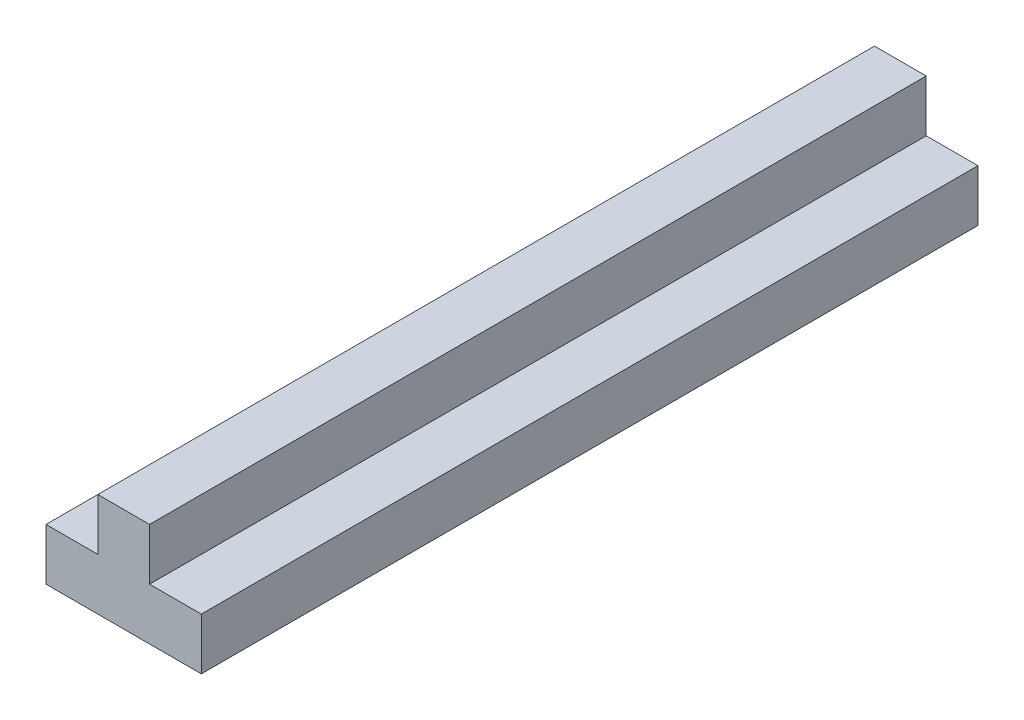
ISO-10303-21;
HEADER;
FILE_DESCRIPTION(('STEP AP214'),'2;1');
FILE_NAME('part.step','',(''),(''),'','','');
FILE_SCHEMA(('AUTOMOTIVE_DESIGN { 1 0 10303 214 1 1 1 1 }'));
ENDSEC;
DATA;
#1=APPLICATION_CONTEXT('core data for automotive mechanical design processes');
#2=APPLICATION_PROTOCOL_DEFINITION('international standard','automotive_design',2000,#1);
#3=PRODUCT_CONTEXT('',#1,'mechanical');
#4=PRODUCT('Part','Part','',(#3));
#5=PRODUCT_RELATED_PRODUCT_CATEGORY('part','',(#4));
#6=PRODUCT_DEFINITION_FORMATION('','',#4);
#7=PRODUCT_DEFINITION_CONTEXT('part definition',#1,'design');
#8=PRODUCT_DEFINITION('design','',#6,#7);
#9=PRODUCT_DEFINITION_SHAPE('','',#8);
#10=(LENGTH_UNIT() NAMED_UNIT(*) SI_UNIT(.MILLI.,.METRE.));
#11=(NAMED_UNIT(*) PLANE_ANGLE_UNIT() SI_UNIT($,.RADIAN.));
#12=(NAMED_UNIT(*) SI_UNIT($,.STERADIAN.) SOLID_ANGLE_UNIT());
#13=UNCERTAINTY_MEASURE_WITH_UNIT(LENGTH_MEASURE(1.E-05),#10,'distance_accuracy_value','');
#14=(GEOMETRIC_REPRESENTATION_CONTEXT(3) GLOBAL_UNCERTAINTY_ASSIGNED_CONTEXT((#13)) GLOBAL_UNIT_ASSIGNED_CONTEXT((#10,
#11,#12)) REPRESENTATION_CONTEXT('',''));
#15=CARTESIAN_POINT('',(0.,0.,0.));
#16=DIRECTION('',(0.,0.,1.));
#17=DIRECTION('',(1.,0.,0.));
#18=AXIS2_PLACEMENT_3D('',#15,#16,#17);
#19=CARTESIAN_POINT('',(-6.35,1.27,38.1));
#20=DIRECTION('',(0.,-1.,0.));
#21=DIRECTION('',(0.,0.,-1.));
#22=AXIS2_PLACEMENT_3D('',#19,#20,#21);
#23=PLANE('',#22);
#24=DIRECTION('',(0.,0.,1.));
#25=VECTOR('',#24,1.);
#26=CARTESIAN_POINT('',(-1.27,1.27,0.));
#27=LINE('',#26,#25);
#28=CARTESIAN_POINT('',(-1.27,1.27,0.));
#29=VERTEX_POINT('',#28);
#30=CARTESIAN_POINT('',(-1.27,1.27,38.1));
#31=VERTEX_POINT('',#30);
#32=EDGE_CURVE('E49',#29,#31,#27,.T.);
#33=ORIENTED_EDGE('',*,*,#32,.F.);
#34=DIRECTION('',(-1.,0.,0.));
#35=VECTOR('',#34,1.);
#36=CARTESIAN_POINT('',(-6.35,1.27,0.));
#37=LINE('',#36,#35);
#38=CARTESIAN_POINT('',(-3.81,1.27,0.));
#39=VERTEX_POINT('',#38);
#40=EDGE_CURVE('E145',#29,#39,#37,.T.);
#41=ORIENTED_EDGE('',*,*,#40,.T.);
#42=DIRECTION('',(0.,0.,-1.));
#43=VECTOR('',#42,1.);
#44=CARTESIAN_POINT('',(-3.81,1.27,0.));
#45=LINE('',#44,#43);
#46=CARTESIAN_POINT('',(-3.81,1.27,38.1));
#47=VERTEX_POINT('',#46);
#48=EDGE_CURVE('E132',#47,#39,#45,.T.);
#49=ORIENTED_EDGE('',*,*,#48,.F.);
#50=DIRECTION('',(-1.,0.,0.));
#51=VECTOR('',#50,1.);
#52=CARTESIAN_POINT('',(-6.35,1.27,38.1));
#53=LINE('',#52,#51);
#54=EDGE_CURVE('E54',#31,#47,#53,.T.);
#55=ORIENTED_EDGE('',*,*,#54,.F.);
#56=EDGE_LOOP('',(#33,#41,#49,#55));
#57=FACE_BOUND('',#56,.T.);
#58=ADVANCED_FACE('F33',(#57),#23,.F.);
#59=DIRECTION('',(0.,0.,-1.));
#60=VECTOR('',#59,1.);
#61=CARTESIAN_POINT('',(1.27,1.27,0.));
#62=LINE('',#61,#60);
#63=CARTESIAN_POINT('',(1.27,1.27,38.1));
#64=VERTEX_POINT('',#63);
#65=CARTESIAN_POINT('',(1.27,1.27,0.));
#66=VERTEX_POINT('',#65);
#67=EDGE_CURVE('E117',#64,#66,#62,.T.);
#68=ORIENTED_EDGE('',*,*,#67,.F.);
#69=CARTESIAN_POINT('',(3.81,1.27,38.1));
#70=VERTEX_POINT('',#69);
#71=EDGE_CURVE('E41',#70,#64,#53,.T.);
#72=ORIENTED_EDGE('',*,*,#71,.F.);
#73=DIRECTION('',(0.,0.,1.));
#74=VECTOR('',#73,1.);
#75=CARTESIAN_POINT('',(3.81,1.27,38.1));
#76=LINE('',#75,#74);
#77=CARTESIAN_POINT('',(3.81,1.27,0.));
#78=VERTEX_POINT('',#77);
#79=EDGE_CURVE('E143',#78,#70,#76,.T.);
#80=ORIENTED_EDGE('',*,*,#79,.F.);
#81=EDGE_CURVE('E146',#78,#66,#37,.T.);
#82=ORIENTED_EDGE('',*,*,#81,.T.);
#83=EDGE_LOOP('',(#68,#72,#80,#82));
#84=FACE_BOUND('',#83,.T.);
#85=ADVANCED_FACE('F167',(#84),#23,.F.);
#86=CARTESIAN_POINT('',(-6.35,-1.27,38.1));
#87=DIRECTION('',(0.,1.,0.));
#88=DIRECTION('',(0.,0.,1.));
#89=AXIS2_PLACEMENT_3D('',#86,#87,#88);
#90=PLANE('',#89);
#91=DIRECTION('',(0.,0.,1.));
#92=VECTOR('',#91,1.);
#93=CARTESIAN_POINT('',(-3.81,-1.27,0.));
#94=LINE('',#93,#92);
#95=CARTESIAN_POINT('',(-3.81,-1.27,0.));
#96=VERTEX_POINT('',#95);
#97=CARTESIAN_POINT('',(-3.81,-1.27,38.1));
#98=VERTEX_POINT('',#97);
#99=EDGE_CURVE('E122',#96,#98,#94,.T.);
#100=ORIENTED_EDGE('',*,*,#99,.F.);
#101=DIRECTION('',(1.,0.,0.));
#102=VECTOR('',#101,1.);
#103=CARTESIAN_POINT('',(-6.35,-1.27,0.));
#104=LINE('',#103,#102);
#105=CARTESIAN_POINT('',(3.81,-1.27,0.));
#106=VERTEX_POINT('',#105);
#107=EDGE_CURVE('E36',#96,#106,#104,.T.);
#108=ORIENTED_EDGE('',*,*,#107,.T.);
#109=DIRECTION('',(0.,0.,-1.));
#110=VECTOR('',#109,1.);
#111=CARTESIAN_POINT('',(3.81,-1.27,38.1));
#112=LINE('',#111,#110);
#113=CARTESIAN_POINT('',(3.81,-1.27,38.1));
#114=VERTEX_POINT('',#113);
#115=EDGE_CURVE('E138',#114,#106,#112,.T.);
#116=ORIENTED_EDGE('',*,*,#115,.F.);
#117=DIRECTION('',(1.,0.,0.));
#118=VECTOR('',#117,1.);
#119=CARTESIAN_POINT('',(-6.35,-1.27,38.1));
#120=LINE('',#119,#118);
#121=EDGE_CURVE('E11',#98,#114,#120,.T.);
#122=ORIENTED_EDGE('',*,*,#121,.F.);
#123=EDGE_LOOP('',(#100,#108,#116,#122));
#124=FACE_BOUND('',#123,.T.);
#125=ADVANCED_FACE('F161',(#124),#90,.F.);
#126=CARTESIAN_POINT('',(0.,0.,38.1));
#127=DIRECTION('',(0.,0.,-1.));
#128=DIRECTION('',(-1.,0.,0.));
#129=AXIS2_PLACEMENT_3D('',#126,#127,#128);
#130=PLANE('',#129);
#131=DIRECTION('',(0.,1.,0.));
#132=VECTOR('',#131,1.);
#133=CARTESIAN_POINT('',(-3.81,1.27,38.1));
#134=LINE('',#133,#132);
#135=EDGE_CURVE('E129',#98,#47,#134,.T.);
#136=ORIENTED_EDGE('',*,*,#135,.F.);
#137=ORIENTED_EDGE('',*,*,#121,.T.);
#138=DIRECTION('',(0.,-1.,0.));
#139=VECTOR('',#138,1.);
#140=CARTESIAN_POINT('',(3.81,1.27,38.1));
#141=LINE('',#140,#139);
#142=EDGE_CURVE('E135',#70,#114,#141,.T.);
#143=ORIENTED_EDGE('',*,*,#142,.F.);
#144=ORIENTED_EDGE('',*,*,#71,.T.);
#145=DIRECTION('',(0.,-1.,0.));
#146=VECTOR('',#145,1.);
#147=CARTESIAN_POINT('',(1.27000000000001,3.81,38.1));
#148=LINE('',#147,#146);
#149=CARTESIAN_POINT('',(1.27000000000001,3.81,38.1));
#150=VERTEX_POINT('',#149);
#151=EDGE_CURVE('E104',#150,#64,#148,.T.);
#152=ORIENTED_EDGE('',*,*,#151,.F.);
#153=DIRECTION('',(1.,0.,0.));
#154=VECTOR('',#153,1.);
#155=CARTESIAN_POINT('',(-1.27,3.81,38.1));
#156=LINE('',#155,#154);
#157=CARTESIAN_POINT('',(-1.27,3.81,38.1));
#158=VERTEX_POINT('',#157);
#159=EDGE_CURVE('E96',#158,#150,#156,.T.);
#160=ORIENTED_EDGE('',*,*,#159,.F.);
#161=DIRECTION('',(0.,-1.,0.));
#162=VECTOR('',#161,1.);
#163=CARTESIAN_POINT('',(-1.27,3.81,38.1));
#164=LINE('',#163,#162);
#165=EDGE_CURVE('E101',#158,#31,#164,.T.);
#166=ORIENTED_EDGE('',*,*,#165,.T.);
#167=ORIENTED_EDGE('',*,*,#54,.T.);
#168=EDGE_LOOP('',(#136,#137,#143,#144,#152,#160,#166,#167));
#169=FACE_BOUND('',#168,.T.);
#170=ADVANCED_FACE('F99',(#169),#130,.F.);
#171=CARTESIAN_POINT('',(0.,0.,0.));
#172=DIRECTION('',(0.,0.,-1.));
#173=DIRECTION('',(-1.,0.,0.));
#174=AXIS2_PLACEMENT_3D('',#171,#172,#173);
#175=PLANE('',#174);
#176=ORIENTED_EDGE('',*,*,#107,.F.);
#177=DIRECTION('',(0.,-1.,0.));
#178=VECTOR('',#177,1.);
#179=CARTESIAN_POINT('',(-3.81,1.27,0.));
#180=LINE('',#179,#178);
#181=EDGE_CURVE('E120',#39,#96,#180,.T.);
#182=ORIENTED_EDGE('',*,*,#181,.F.);
#183=ORIENTED_EDGE('',*,*,#40,.F.);
#184=DIRECTION('',(0.,-1.,0.));
#185=VECTOR('',#184,1.);
#186=CARTESIAN_POINT('',(-1.27,3.81,0.));
#187=LINE('',#186,#185);
#188=CARTESIAN_POINT('',(-1.27,3.81,0.));
#189=VERTEX_POINT('',#188);
#190=EDGE_CURVE('E175',#189,#29,#187,.T.);
#191=ORIENTED_EDGE('',*,*,#190,.F.);
#192=DIRECTION('',(-1.,0.,0.));
#193=VECTOR('',#192,1.);
#194=CARTESIAN_POINT('',(-1.27,3.81,0.));
#195=LINE('',#194,#193);
#196=CARTESIAN_POINT('',(1.27,3.81,0.));
#197=VERTEX_POINT('',#196);
#198=EDGE_CURVE('E113',#197,#189,#195,.T.);
#199=ORIENTED_EDGE('',*,*,#198,.F.);
#200=DIRECTION('',(0.,-1.,0.));
#201=VECTOR('',#200,1.);
#202=CARTESIAN_POINT('',(1.27,3.81,0.));
#203=LINE('',#202,#201);
#204=EDGE_CURVE('E124',#197,#66,#203,.T.);
#205=ORIENTED_EDGE('',*,*,#204,.T.);
#206=ORIENTED_EDGE('',*,*,#81,.F.);
#207=DIRECTION('',(0.,1.,0.));
#208=VECTOR('',#207,1.);
#209=CARTESIAN_POINT('',(3.81,1.27,0.));
#210=LINE('',#209,#208);
#211=EDGE_CURVE('E141',#106,#78,#210,.T.);
#212=ORIENTED_EDGE('',*,*,#211,.F.);
#213=EDGE_LOOP('',(#176,#182,#183,#191,#199,#205,#206,#212));
#214=FACE_BOUND('',#213,.T.);
#215=ADVANCED_FACE('F157',(#214),#175,.T.);
#216=CARTESIAN_POINT('',(3.81,0.,0.));
#217=DIRECTION('',(1.,0.,0.));
#218=DIRECTION('',(0.,0.,-1.));
#219=AXIS2_PLACEMENT_3D('',#216,#217,#218);
#220=PLANE('',#219);
#221=ORIENTED_EDGE('',*,*,#142,.T.);
#222=ORIENTED_EDGE('',*,*,#115,.T.);
#223=ORIENTED_EDGE('',*,*,#211,.T.);
#224=ORIENTED_EDGE('',*,*,#79,.T.);
#225=EDGE_LOOP('',(#221,#222,#223,#224));
#226=FACE_BOUND('',#225,.T.);
#227=ADVANCED_FACE('F164',(#226),#220,.T.);
#228=CARTESIAN_POINT('',(-3.81,0.,0.));
#229=DIRECTION('',(-1.,0.,0.));
#230=DIRECTION('',(0.,0.,1.));
#231=AXIS2_PLACEMENT_3D('',#228,#229,#230);
#232=PLANE('',#231);
#233=ORIENTED_EDGE('',*,*,#181,.T.);
#234=ORIENTED_EDGE('',*,*,#99,.T.);
#235=ORIENTED_EDGE('',*,*,#135,.T.);
#236=ORIENTED_EDGE('',*,*,#48,.T.);
#237=EDGE_LOOP('',(#233,#234,#235,#236));
#238=FACE_BOUND('',#237,.T.);
#239=ADVANCED_FACE('F154',(#238),#232,.T.);
#240=CARTESIAN_POINT('',(-1.27,3.81,0.));
#241=DIRECTION('',(1.,0.,0.));
#242=DIRECTION('',(0.,0.,-1.));
#243=AXIS2_PLACEMENT_3D('',#240,#241,#242);
#244=PLANE('',#243);
#245=ORIENTED_EDGE('',*,*,#32,.T.);
#246=ORIENTED_EDGE('',*,*,#165,.F.);
#247=DIRECTION('',(0.,0.,1.));
#248=VECTOR('',#247,1.);
#249=CARTESIAN_POINT('',(-1.27,3.81,0.));
#250=LINE('',#249,#248);
#251=EDGE_CURVE('E108',#189,#158,#250,.T.);
#252=ORIENTED_EDGE('',*,*,#251,.F.);
#253=ORIENTED_EDGE('',*,*,#190,.T.);
#254=EDGE_LOOP('',(#245,#246,#252,#253));
#255=FACE_BOUND('',#254,.T.);
#256=ADVANCED_FACE('F119',(#255),#244,.F.);
#257=CARTESIAN_POINT('',(1.27,3.81,0.));
#258=DIRECTION('',(-1.,0.,0.));
#259=DIRECTION('',(0.,0.,1.));
#260=AXIS2_PLACEMENT_3D('',#257,#258,#259);
#261=PLANE('',#260);
#262=ORIENTED_EDGE('',*,*,#67,.T.);
#263=ORIENTED_EDGE('',*,*,#204,.F.);
#264=DIRECTION('',(0.,0.,-1.));
#265=VECTOR('',#264,1.);
#266=CARTESIAN_POINT('',(1.27,3.81,0.));
#267=LINE('',#266,#265);
#268=EDGE_CURVE('E107',#150,#197,#267,.T.);
#269=ORIENTED_EDGE('',*,*,#268,.F.);
#270=ORIENTED_EDGE('',*,*,#151,.T.);
#271=EDGE_LOOP('',(#262,#263,#269,#270));
#272=FACE_BOUND('',#271,.T.);
#273=ADVANCED_FACE('F176',(#272),#261,.F.);
#274=CARTESIAN_POINT('',(0.,3.81,0.));
#275=DIRECTION('',(0.,1.,0.));
#276=DIRECTION('',(0.,0.,1.));
#277=AXIS2_PLACEMENT_3D('',#274,#275,#276);
#278=PLANE('',#277);
#279=ORIENTED_EDGE('',*,*,#251,.T.);
#280=ORIENTED_EDGE('',*,*,#159,.T.);
#281=ORIENTED_EDGE('',*,*,#268,.T.);
#282=ORIENTED_EDGE('',*,*,#198,.T.);
#283=EDGE_LOOP('',(#279,#280,#281,#282));
#284=FACE_BOUND('',#283,.T.);
#285=ADVANCED_FACE('F111',(#284),#278,.T.);
#286=CLOSED_SHELL('',(#58,#85,#125,#170,#215,#227,#239,#256,#273,#285));
#287=MANIFOLD_SOLID_BREP('B2',#286);
#288=ADVANCED_BREP_SHAPE_REPRESENTATION('',(#18,#287),#14);
#289=SHAPE_DEFINITION_REPRESENTATION(#9,#288);
ENDSEC;
END-ISO-10303-21;
